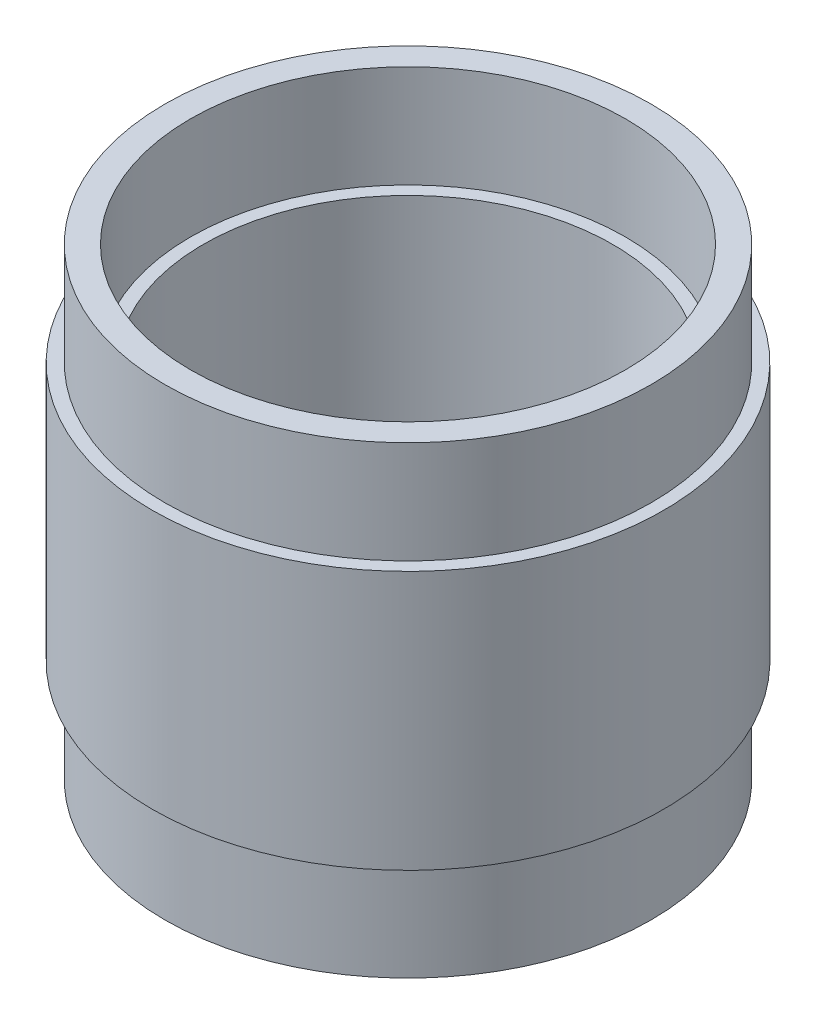
ISO-10303-21;
HEADER;
FILE_DESCRIPTION(('STEP AP214'),'2;1');
FILE_NAME('part.step','',(''),(''),'','','');
FILE_SCHEMA(('AUTOMOTIVE_DESIGN { 1 0 10303 214 1 1 1 1 }'));
ENDSEC;
DATA;
#1=APPLICATION_CONTEXT('core data for automotive mechanical design processes');
#2=APPLICATION_PROTOCOL_DEFINITION('international standard','automotive_design',2000,#1);
#3=PRODUCT_CONTEXT('',#1,'mechanical');
#4=PRODUCT('Part','Part','',(#3));
#5=PRODUCT_RELATED_PRODUCT_CATEGORY('part','',(#4));
#6=PRODUCT_DEFINITION_FORMATION('','',#4);
#7=PRODUCT_DEFINITION_CONTEXT('part definition',#1,'design');
#8=PRODUCT_DEFINITION('design','',#6,#7);
#9=PRODUCT_DEFINITION_SHAPE('','',#8);
#10=(LENGTH_UNIT() NAMED_UNIT(*) SI_UNIT(.MILLI.,.METRE.));
#11=(NAMED_UNIT(*) PLANE_ANGLE_UNIT() SI_UNIT($,.RADIAN.));
#12=(NAMED_UNIT(*) SI_UNIT($,.STERADIAN.) SOLID_ANGLE_UNIT());
#13=UNCERTAINTY_MEASURE_WITH_UNIT(LENGTH_MEASURE(1.E-05),#10,'distance_accuracy_value','');
#14=(GEOMETRIC_REPRESENTATION_CONTEXT(3) GLOBAL_UNCERTAINTY_ASSIGNED_CONTEXT((#13)) GLOBAL_UNIT_ASSIGNED_CONTEXT((#10,
#11,#12)) REPRESENTATION_CONTEXT('',''));
#15=CARTESIAN_POINT('',(0.,0.,0.));
#16=DIRECTION('',(0.,0.,1.));
#17=DIRECTION('',(1.,0.,0.));
#18=AXIS2_PLACEMENT_3D('',#15,#16,#17);
#19=CARTESIAN_POINT('',(0.,132.254272853125,0.));
#20=DIRECTION('',(0.,1.,0.));
#21=DIRECTION('',(0.,0.,1.));
#22=AXIS2_PLACEMENT_3D('',#19,#20,#21);
#23=CYLINDRICAL_SURFACE('',#22,60.325);
#24=CARTESIAN_POINT('',(0.,0.,0.));
#25=DIRECTION('',(0.,1.,0.));
#26=DIRECTION('',(0.,0.,1.));
#27=AXIS2_PLACEMENT_3D('',#24,#25,#26);
#28=CIRCLE('',#27,60.325);
#29=CARTESIAN_POINT('',(0.,0.,60.325));
#30=VERTEX_POINT('',#29);
#31=EDGE_CURVE('E10',#30,#30,#28,.T.);
#32=ORIENTED_EDGE('',*,*,#31,.T.);
#33=EDGE_LOOP('',(#32));
#34=FACE_BOUND('',#33,.T.);
#35=CARTESIAN_POINT('',(0.,25.4,0.));
#36=DIRECTION('',(0.,1.,0.));
#37=DIRECTION('',(0.,0.,1.));
#38=AXIS2_PLACEMENT_3D('',#35,#36,#37);
#39=CIRCLE('',#38,60.325);
#40=CARTESIAN_POINT('',(0.,25.4,60.325));
#41=VERTEX_POINT('',#40);
#42=EDGE_CURVE('E71',#41,#41,#39,.T.);
#43=ORIENTED_EDGE('',*,*,#42,.F.);
#44=EDGE_LOOP('',(#43));
#45=FACE_BOUND('',#44,.T.);
#46=ADVANCED_FACE('F31',(#34,#45),#23,.T.);
#47=CARTESIAN_POINT('',(-60.325,0.,0.));
#48=DIRECTION('',(0.,-1.,0.));
#49=DIRECTION('',(0.,0.,-1.));
#50=AXIS2_PLACEMENT_3D('',#47,#48,#49);
#51=PLANE('',#50);
#52=CARTESIAN_POINT('',(0.,0.,0.));
#53=DIRECTION('',(0.,1.,0.));
#54=DIRECTION('',(0.,0.,1.));
#55=AXIS2_PLACEMENT_3D('',#52,#53,#54);
#56=CIRCLE('',#55,53.975);
#57=CARTESIAN_POINT('',(0.,0.,53.975));
#58=VERTEX_POINT('',#57);
#59=EDGE_CURVE('E37',#58,#58,#56,.T.);
#60=ORIENTED_EDGE('',*,*,#59,.T.);
#61=EDGE_LOOP('',(#60));
#62=FACE_BOUND('',#61,.T.);
#63=ORIENTED_EDGE('',*,*,#31,.F.);
#64=EDGE_LOOP('',(#63));
#65=FACE_BOUND('',#64,.T.);
#66=ADVANCED_FACE('F79',(#62,#65),#51,.T.);
#67=CARTESIAN_POINT('',(0.,132.254272853125,0.));
#68=DIRECTION('',(0.,1.,0.));
#69=DIRECTION('',(0.,0.,1.));
#70=AXIS2_PLACEMENT_3D('',#67,#68,#69);
#71=CYLINDRICAL_SURFACE('',#70,53.975);
#72=CARTESIAN_POINT('',(0.,25.4,0.));
#73=DIRECTION('',(0.,1.,0.));
#74=DIRECTION('',(0.,0.,1.));
#75=AXIS2_PLACEMENT_3D('',#72,#73,#74);
#76=CIRCLE('',#75,53.975);
#77=CARTESIAN_POINT('',(0.,25.4,53.975));
#78=VERTEX_POINT('',#77);
#79=EDGE_CURVE('E41',#78,#78,#76,.T.);
#80=ORIENTED_EDGE('',*,*,#79,.T.);
#81=EDGE_LOOP('',(#80));
#82=FACE_BOUND('',#81,.T.);
#83=ORIENTED_EDGE('',*,*,#59,.F.);
#84=EDGE_LOOP('',(#83));
#85=FACE_BOUND('',#84,.T.);
#86=ADVANCED_FACE('F83',(#82,#85),#71,.F.);
#87=CARTESIAN_POINT('',(-50.8,25.4,0.));
#88=DIRECTION('',(0.,-1.,0.));
#89=DIRECTION('',(0.,0.,-1.));
#90=AXIS2_PLACEMENT_3D('',#87,#88,#89);
#91=PLANE('',#90);
#92=CARTESIAN_POINT('',(0.,25.4,0.));
#93=DIRECTION('',(0.,1.,0.));
#94=DIRECTION('',(0.,0.,1.));
#95=AXIS2_PLACEMENT_3D('',#92,#93,#94);
#96=CIRCLE('',#95,50.8);
#97=CARTESIAN_POINT('',(0.,25.4,50.8));
#98=VERTEX_POINT('',#97);
#99=EDGE_CURVE('E45',#98,#98,#96,.T.);
#100=ORIENTED_EDGE('',*,*,#99,.T.);
#101=EDGE_LOOP('',(#100));
#102=FACE_BOUND('',#101,.T.);
#103=ORIENTED_EDGE('',*,*,#79,.F.);
#104=EDGE_LOOP('',(#103));
#105=FACE_BOUND('',#104,.T.);
#106=ADVANCED_FACE('F87',(#102,#105),#91,.T.);
#107=CARTESIAN_POINT('',(0.,132.254272853125,0.));
#108=DIRECTION('',(0.,1.,0.));
#109=DIRECTION('',(0.,0.,1.));
#110=AXIS2_PLACEMENT_3D('',#107,#108,#109);
#111=CYLINDRICAL_SURFACE('',#110,50.8);
#112=CARTESIAN_POINT('',(0.,89.662,0.));
#113=DIRECTION('',(0.,1.,0.));
#114=DIRECTION('',(0.,0.,1.));
#115=AXIS2_PLACEMENT_3D('',#112,#113,#114);
#116=CIRCLE('',#115,50.8);
#117=CARTESIAN_POINT('',(0.,89.662,50.8));
#118=VERTEX_POINT('',#117);
#119=EDGE_CURVE('E50',#118,#118,#116,.T.);
#120=ORIENTED_EDGE('',*,*,#119,.T.);
#121=EDGE_LOOP('',(#120));
#122=FACE_BOUND('',#121,.T.);
#123=ORIENTED_EDGE('',*,*,#99,.F.);
#124=EDGE_LOOP('',(#123));
#125=FACE_BOUND('',#124,.T.);
#126=ADVANCED_FACE('F94',(#122,#125),#111,.F.);
#127=CARTESIAN_POINT('',(-53.975,89.662,0.));
#128=DIRECTION('',(0.,1.,0.));
#129=DIRECTION('',(0.,0.,1.));
#130=AXIS2_PLACEMENT_3D('',#127,#128,#129);
#131=PLANE('',#130);
#132=CARTESIAN_POINT('',(0.,89.662,0.));
#133=DIRECTION('',(0.,1.,0.));
#134=DIRECTION('',(0.,0.,1.));
#135=AXIS2_PLACEMENT_3D('',#132,#133,#134);
#136=CIRCLE('',#135,53.975);
#137=CARTESIAN_POINT('',(0.,89.662,53.975));
#138=VERTEX_POINT('',#137);
#139=EDGE_CURVE('E53',#138,#138,#136,.T.);
#140=ORIENTED_EDGE('',*,*,#139,.T.);
#141=EDGE_LOOP('',(#140));
#142=FACE_BOUND('',#141,.T.);
#143=ORIENTED_EDGE('',*,*,#119,.F.);
#144=EDGE_LOOP('',(#143));
#145=FACE_BOUND('',#144,.T.);
#146=ADVANCED_FACE('F98',(#142,#145),#131,.T.);
#147=CARTESIAN_POINT('',(0.,132.254272853125,0.));
#148=DIRECTION('',(0.,1.,0.));
#149=DIRECTION('',(0.,0.,1.));
#150=AXIS2_PLACEMENT_3D('',#147,#148,#149);
#151=CYLINDRICAL_SURFACE('',#150,53.975);
#152=CARTESIAN_POINT('',(0.,115.062,0.));
#153=DIRECTION('',(0.,1.,0.));
#154=DIRECTION('',(0.,0.,1.));
#155=AXIS2_PLACEMENT_3D('',#152,#153,#154);
#156=CIRCLE('',#155,53.975);
#157=CARTESIAN_POINT('',(0.,115.062,53.975));
#158=VERTEX_POINT('',#157);
#159=EDGE_CURVE('E56',#158,#158,#156,.T.);
#160=ORIENTED_EDGE('',*,*,#159,.T.);
#161=EDGE_LOOP('',(#160));
#162=FACE_BOUND('',#161,.T.);
#163=ORIENTED_EDGE('',*,*,#139,.F.);
#164=EDGE_LOOP('',(#163));
#165=FACE_BOUND('',#164,.T.);
#166=ADVANCED_FACE('F102',(#162,#165),#151,.F.);
#167=CARTESIAN_POINT('',(-60.325,115.062,0.));
#168=DIRECTION('',(0.,1.,0.));
#169=DIRECTION('',(0.,0.,1.));
#170=AXIS2_PLACEMENT_3D('',#167,#168,#169);
#171=PLANE('',#170);
#172=CARTESIAN_POINT('',(0.,115.062,0.));
#173=DIRECTION('',(0.,1.,0.));
#174=DIRECTION('',(0.,0.,1.));
#175=AXIS2_PLACEMENT_3D('',#172,#173,#174);
#176=CIRCLE('',#175,60.325);
#177=CARTESIAN_POINT('',(0.,115.062,60.325));
#178=VERTEX_POINT('',#177);
#179=EDGE_CURVE('E59',#178,#178,#176,.T.);
#180=ORIENTED_EDGE('',*,*,#179,.T.);
#181=EDGE_LOOP('',(#180));
#182=FACE_BOUND('',#181,.T.);
#183=ORIENTED_EDGE('',*,*,#159,.F.);
#184=EDGE_LOOP('',(#183));
#185=FACE_BOUND('',#184,.T.);
#186=ADVANCED_FACE('F106',(#182,#185),#171,.T.);
#187=CARTESIAN_POINT('',(0.,132.254272853125,0.));
#188=DIRECTION('',(0.,1.,0.));
#189=DIRECTION('',(0.,0.,1.));
#190=AXIS2_PLACEMENT_3D('',#187,#188,#189);
#191=CYLINDRICAL_SURFACE('',#190,60.325);
#192=CARTESIAN_POINT('',(0.,89.662,0.));
#193=DIRECTION('',(0.,1.,0.));
#194=DIRECTION('',(0.,0.,1.));
#195=AXIS2_PLACEMENT_3D('',#192,#193,#194);
#196=CIRCLE('',#195,60.325);
#197=CARTESIAN_POINT('',(0.,89.662,60.325));
#198=VERTEX_POINT('',#197);
#199=EDGE_CURVE('E62',#198,#198,#196,.T.);
#200=ORIENTED_EDGE('',*,*,#199,.T.);
#201=EDGE_LOOP('',(#200));
#202=FACE_BOUND('',#201,.T.);
#203=ORIENTED_EDGE('',*,*,#179,.F.);
#204=EDGE_LOOP('',(#203));
#205=FACE_BOUND('',#204,.T.);
#206=ADVANCED_FACE('F110',(#202,#205),#191,.T.);
#207=CARTESIAN_POINT('',(-60.325,89.662,0.));
#208=DIRECTION('',(0.,1.,0.));
#209=DIRECTION('',(0.,0.,1.));
#210=AXIS2_PLACEMENT_3D('',#207,#208,#209);
#211=PLANE('',#210);
#212=CARTESIAN_POINT('',(0.,89.662,0.));
#213=DIRECTION('',(0.,1.,0.));
#214=DIRECTION('',(0.,0.,1.));
#215=AXIS2_PLACEMENT_3D('',#212,#213,#214);
#216=CIRCLE('',#215,63.5);
#217=CARTESIAN_POINT('',(0.,89.662,63.5));
#218=VERTEX_POINT('',#217);
#219=EDGE_CURVE('E65',#218,#218,#216,.T.);
#220=ORIENTED_EDGE('',*,*,#219,.T.);
#221=EDGE_LOOP('',(#220));
#222=FACE_BOUND('',#221,.T.);
#223=ORIENTED_EDGE('',*,*,#199,.F.);
#224=EDGE_LOOP('',(#223));
#225=FACE_BOUND('',#224,.T.);
#226=ADVANCED_FACE('F114',(#222,#225),#211,.T.);
#227=CARTESIAN_POINT('',(0.,132.254272853125,0.));
#228=DIRECTION('',(0.,1.,0.));
#229=DIRECTION('',(0.,0.,1.));
#230=AXIS2_PLACEMENT_3D('',#227,#228,#229);
#231=CYLINDRICAL_SURFACE('',#230,63.5);
#232=CARTESIAN_POINT('',(0.,25.4,0.));
#233=DIRECTION('',(0.,1.,0.));
#234=DIRECTION('',(0.,0.,1.));
#235=AXIS2_PLACEMENT_3D('',#232,#233,#234);
#236=CIRCLE('',#235,63.5);
#237=CARTESIAN_POINT('',(0.,25.4,63.5));
#238=VERTEX_POINT('',#237);
#239=EDGE_CURVE('E68',#238,#238,#236,.T.);
#240=ORIENTED_EDGE('',*,*,#239,.T.);
#241=EDGE_LOOP('',(#240));
#242=FACE_BOUND('',#241,.T.);
#243=ORIENTED_EDGE('',*,*,#219,.F.);
#244=EDGE_LOOP('',(#243));
#245=FACE_BOUND('',#244,.T.);
#246=ADVANCED_FACE('F118',(#242,#245),#231,.T.);
#247=CARTESIAN_POINT('',(-63.5,25.4,0.));
#248=DIRECTION('',(0.,-1.,0.));
#249=DIRECTION('',(0.,0.,-1.));
#250=AXIS2_PLACEMENT_3D('',#247,#248,#249);
#251=PLANE('',#250);
#252=ORIENTED_EDGE('',*,*,#42,.T.);
#253=EDGE_LOOP('',(#252));
#254=FACE_BOUND('',#253,.T.);
#255=ORIENTED_EDGE('',*,*,#239,.F.);
#256=EDGE_LOOP('',(#255));
#257=FACE_BOUND('',#256,.T.);
#258=ADVANCED_FACE('F75',(#254,#257),#251,.T.);
#259=CLOSED_SHELL('',(#46,#66,#86,#106,#126,#146,#166,#186,#206,#226,#246,#258));
#260=MANIFOLD_SOLID_BREP('B2',#259);
#261=ADVANCED_BREP_SHAPE_REPRESENTATION('',(#18,#260),#14);
#262=SHAPE_DEFINITION_REPRESENTATION(#9,#261);
ENDSEC;
END-ISO-10303-21;
